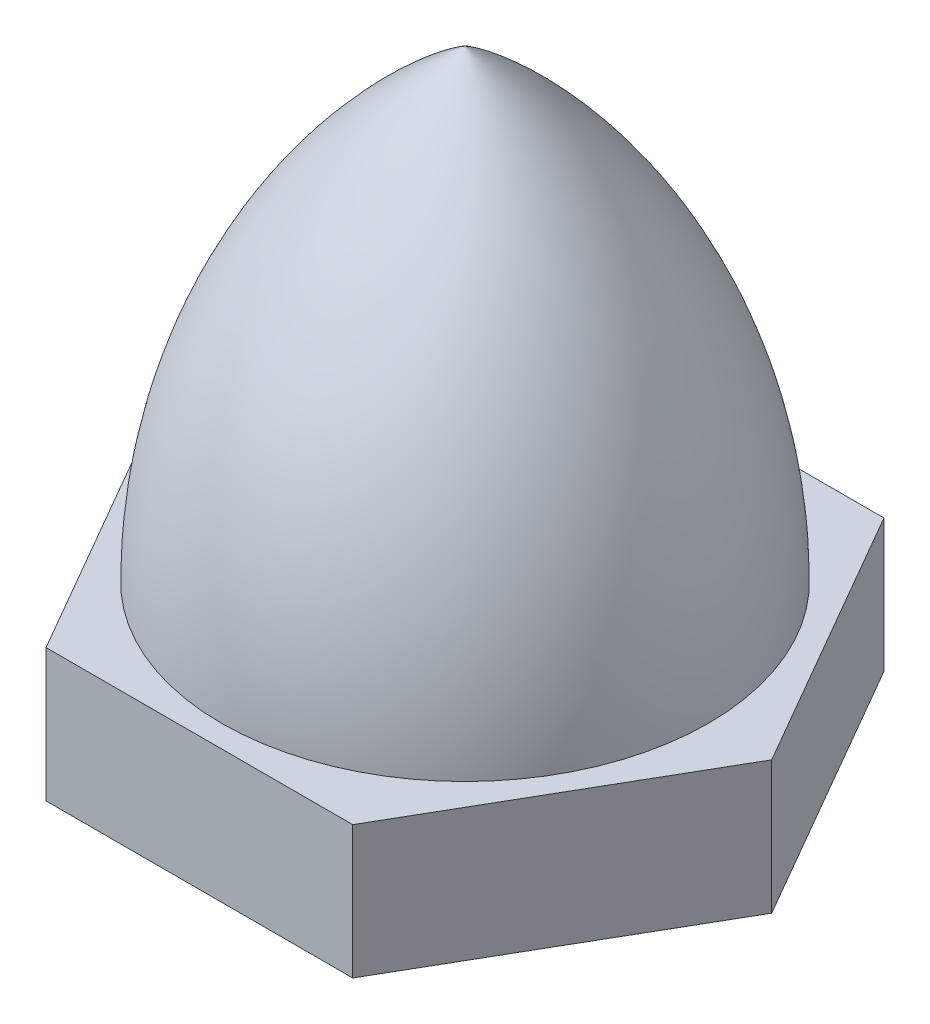
ISO-10303-21;
HEADER;
FILE_DESCRIPTION(('STEP AP214'),'2;1');
FILE_NAME('part.step','',(''),(''),'','','');
FILE_SCHEMA(('AUTOMOTIVE_DESIGN { 1 0 10303 214 1 1 1 1 }'));
ENDSEC;
DATA;
#1=APPLICATION_CONTEXT('core data for automotive mechanical design processes');
#2=APPLICATION_PROTOCOL_DEFINITION('international standard','automotive_design',2000,#1);
#3=PRODUCT_CONTEXT('',#1,'mechanical');
#4=PRODUCT('Part','Part','',(#3));
#5=PRODUCT_RELATED_PRODUCT_CATEGORY('part','',(#4));
#6=PRODUCT_DEFINITION_FORMATION('','',#4);
#7=PRODUCT_DEFINITION_CONTEXT('part definition',#1,'design');
#8=PRODUCT_DEFINITION('design','',#6,#7);
#9=PRODUCT_DEFINITION_SHAPE('','',#8);
#10=(LENGTH_UNIT() NAMED_UNIT(*) SI_UNIT(.MILLI.,.METRE.));
#11=(NAMED_UNIT(*) PLANE_ANGLE_UNIT() SI_UNIT($,.RADIAN.));
#12=(NAMED_UNIT(*) SI_UNIT($,.STERADIAN.) SOLID_ANGLE_UNIT());
#13=UNCERTAINTY_MEASURE_WITH_UNIT(LENGTH_MEASURE(1.E-05),#10,'distance_accuracy_value','');
#14=(GEOMETRIC_REPRESENTATION_CONTEXT(3) GLOBAL_UNCERTAINTY_ASSIGNED_CONTEXT((#13)) GLOBAL_UNIT_ASSIGNED_CONTEXT((#10,
#11,#12)) REPRESENTATION_CONTEXT('',''));
#15=CARTESIAN_POINT('',(0.,0.,0.));
#16=DIRECTION('',(0.,0.,1.));
#17=DIRECTION('',(1.,0.,0.));
#18=AXIS2_PLACEMENT_3D('',#15,#16,#17);
#19=CARTESIAN_POINT('',(3.46410161513776,3.,6.));
#20=DIRECTION('',(-0.866025403784439,0.,-0.5));
#21=DIRECTION('',(-0.5,0.,0.866025403784439));
#22=AXIS2_PLACEMENT_3D('',#19,#20,#21);
#23=PLANE('',#22);
#24=DIRECTION('',(0.5,0.,-0.866025403784439));
#25=VECTOR('',#24,1.);
#26=CARTESIAN_POINT('',(3.46410161513776,0.,6.));
#27=LINE('',#26,#25);
#28=CARTESIAN_POINT('',(3.46410161513776,0.,6.));
#29=VERTEX_POINT('',#28);
#30=CARTESIAN_POINT('',(6.92820323027551,0.,0.));
#31=VERTEX_POINT('',#30);
#32=EDGE_CURVE('E125',#29,#31,#27,.T.);
#33=ORIENTED_EDGE('',*,*,#32,.T.);
#34=DIRECTION('',(0.,-1.,0.));
#35=VECTOR('',#34,1.);
#36=CARTESIAN_POINT('',(6.92820323027551,3.,0.));
#37=LINE('',#36,#35);
#38=CARTESIAN_POINT('',(6.92820323027551,3.,0.));
#39=VERTEX_POINT('',#38);
#40=EDGE_CURVE('E45',#39,#31,#37,.T.);
#41=ORIENTED_EDGE('',*,*,#40,.F.);
#42=DIRECTION('',(0.5,0.,-0.866025403784439));
#43=VECTOR('',#42,1.);
#44=CARTESIAN_POINT('',(3.46410161513776,3.,6.));
#45=LINE('',#44,#43);
#46=CARTESIAN_POINT('',(3.46410161513776,3.,6.));
#47=VERTEX_POINT('',#46);
#48=EDGE_CURVE('E136',#47,#39,#45,.T.);
#49=ORIENTED_EDGE('',*,*,#48,.F.);
#50=DIRECTION('',(0.,-1.,0.));
#51=VECTOR('',#50,1.);
#52=CARTESIAN_POINT('',(3.46410161513776,3.,6.));
#53=LINE('',#52,#51);
#54=EDGE_CURVE('E121',#47,#29,#53,.T.);
#55=ORIENTED_EDGE('',*,*,#54,.T.);
#56=EDGE_LOOP('',(#33,#41,#49,#55));
#57=FACE_BOUND('',#56,.T.);
#58=ADVANCED_FACE('F37',(#57),#23,.F.);
#59=CARTESIAN_POINT('',(6.92820323027551,3.,0.));
#60=DIRECTION('',(-0.866025403784439,0.,0.5));
#61=DIRECTION('',(0.5,0.,0.866025403784439));
#62=AXIS2_PLACEMENT_3D('',#59,#60,#61);
#63=PLANE('',#62);
#64=DIRECTION('',(-0.5,0.,-0.866025403784439));
#65=VECTOR('',#64,1.);
#66=CARTESIAN_POINT('',(6.92820323027551,0.,0.));
#67=LINE('',#66,#65);
#68=CARTESIAN_POINT('',(3.46410161513775,0.,-6.));
#69=VERTEX_POINT('',#68);
#70=EDGE_CURVE('E128',#31,#69,#67,.T.);
#71=ORIENTED_EDGE('',*,*,#70,.T.);
#72=DIRECTION('',(0.,-1.,0.));
#73=VECTOR('',#72,1.);
#74=CARTESIAN_POINT('',(3.46410161513775,3.,-6.));
#75=LINE('',#74,#73);
#76=CARTESIAN_POINT('',(3.46410161513775,3.,-6.));
#77=VERTEX_POINT('',#76);
#78=EDGE_CURVE('E140',#77,#69,#75,.T.);
#79=ORIENTED_EDGE('',*,*,#78,.F.);
#80=DIRECTION('',(-0.5,0.,-0.866025403784439));
#81=VECTOR('',#80,1.);
#82=CARTESIAN_POINT('',(6.92820323027551,3.,0.));
#83=LINE('',#82,#81);
#84=EDGE_CURVE('E92',#39,#77,#83,.T.);
#85=ORIENTED_EDGE('',*,*,#84,.F.);
#86=ORIENTED_EDGE('',*,*,#40,.T.);
#87=EDGE_LOOP('',(#71,#79,#85,#86));
#88=FACE_BOUND('',#87,.T.);
#89=ADVANCED_FACE('F143',(#88),#63,.F.);
#90=CARTESIAN_POINT('',(3.46410161513775,3.,-6.));
#91=DIRECTION('',(0.,0.,1.));
#92=DIRECTION('',(1.,0.,0.));
#93=AXIS2_PLACEMENT_3D('',#90,#91,#92);
#94=PLANE('',#93);
#95=DIRECTION('',(-1.,0.,0.));
#96=VECTOR('',#95,1.);
#97=CARTESIAN_POINT('',(3.46410161513775,0.,-6.));
#98=LINE('',#97,#96);
#99=CARTESIAN_POINT('',(-3.46410161513775,0.,-6.));
#100=VERTEX_POINT('',#99);
#101=EDGE_CURVE('E131',#69,#100,#98,.T.);
#102=ORIENTED_EDGE('',*,*,#101,.T.);
#103=DIRECTION('',(0.,-1.,0.));
#104=VECTOR('',#103,1.);
#105=CARTESIAN_POINT('',(-3.46410161513775,3.,-6.));
#106=LINE('',#105,#104);
#107=CARTESIAN_POINT('',(-3.46410161513775,3.,-6.));
#108=VERTEX_POINT('',#107);
#109=EDGE_CURVE('E116',#108,#100,#106,.T.);
#110=ORIENTED_EDGE('',*,*,#109,.F.);
#111=DIRECTION('',(-1.,0.,0.));
#112=VECTOR('',#111,1.);
#113=CARTESIAN_POINT('',(3.46410161513775,3.,-6.));
#114=LINE('',#113,#112);
#115=EDGE_CURVE('E107',#77,#108,#114,.T.);
#116=ORIENTED_EDGE('',*,*,#115,.F.);
#117=ORIENTED_EDGE('',*,*,#78,.T.);
#118=EDGE_LOOP('',(#102,#110,#116,#117));
#119=FACE_BOUND('',#118,.T.);
#120=ADVANCED_FACE('F151',(#119),#94,.F.);
#121=CARTESIAN_POINT('',(-3.46410161513775,3.,-6.));
#122=DIRECTION('',(0.866025403784439,0.,0.5));
#123=DIRECTION('',(0.5,0.,-0.866025403784439));
#124=AXIS2_PLACEMENT_3D('',#121,#122,#123);
#125=PLANE('',#124);
#126=DIRECTION('',(-0.5,0.,0.866025403784438));
#127=VECTOR('',#126,1.);
#128=CARTESIAN_POINT('',(-3.46410161513775,0.,-6.));
#129=LINE('',#128,#127);
#130=CARTESIAN_POINT('',(-6.92820323027551,0.,0.));
#131=VERTEX_POINT('',#130);
#132=EDGE_CURVE('E115',#100,#131,#129,.T.);
#133=ORIENTED_EDGE('',*,*,#132,.T.);
#134=DIRECTION('',(0.,-1.,0.));
#135=VECTOR('',#134,1.);
#136=CARTESIAN_POINT('',(-6.92820323027551,3.,0.));
#137=LINE('',#136,#135);
#138=CARTESIAN_POINT('',(-6.92820323027551,3.,0.));
#139=VERTEX_POINT('',#138);
#140=EDGE_CURVE('E112',#139,#131,#137,.T.);
#141=ORIENTED_EDGE('',*,*,#140,.F.);
#142=DIRECTION('',(-0.5,0.,0.866025403784438));
#143=VECTOR('',#142,1.);
#144=CARTESIAN_POINT('',(-3.46410161513775,3.,-6.));
#145=LINE('',#144,#143);
#146=EDGE_CURVE('E101',#108,#139,#145,.T.);
#147=ORIENTED_EDGE('',*,*,#146,.F.);
#148=ORIENTED_EDGE('',*,*,#109,.T.);
#149=EDGE_LOOP('',(#133,#141,#147,#148));
#150=FACE_BOUND('',#149,.T.);
#151=ADVANCED_FACE('F113',(#150),#125,.F.);
#152=CARTESIAN_POINT('',(-6.92820323027551,3.,0.));
#153=DIRECTION('',(0.866025403784438,0.,-0.500000000000001));
#154=DIRECTION('',(-0.500000000000001,0.,-0.866025403784438));
#155=AXIS2_PLACEMENT_3D('',#152,#153,#154);
#156=PLANE('',#155);
#157=DIRECTION('',(0.5,0.,0.866025403784438));
#158=VECTOR('',#157,1.);
#159=CARTESIAN_POINT('',(-6.92820323027551,0.,0.));
#160=LINE('',#159,#158);
#161=CARTESIAN_POINT('',(-3.46410161513775,0.,6.));
#162=VERTEX_POINT('',#161);
#163=EDGE_CURVE('E77',#131,#162,#160,.T.);
#164=ORIENTED_EDGE('',*,*,#163,.T.);
#165=DIRECTION('',(0.,-1.,0.));
#166=VECTOR('',#165,1.);
#167=CARTESIAN_POINT('',(-3.46410161513775,3.,6.));
#168=LINE('',#167,#166);
#169=CARTESIAN_POINT('',(-3.46410161513775,3.,6.));
#170=VERTEX_POINT('',#169);
#171=EDGE_CURVE('E117',#170,#162,#168,.T.);
#172=ORIENTED_EDGE('',*,*,#171,.F.);
#173=DIRECTION('',(0.5,0.,0.866025403784438));
#174=VECTOR('',#173,1.);
#175=CARTESIAN_POINT('',(-6.92820323027551,3.,0.));
#176=LINE('',#175,#174);
#177=EDGE_CURVE('E105',#139,#170,#176,.T.);
#178=ORIENTED_EDGE('',*,*,#177,.F.);
#179=ORIENTED_EDGE('',*,*,#140,.T.);
#180=EDGE_LOOP('',(#164,#172,#178,#179));
#181=FACE_BOUND('',#180,.T.);
#182=ADVANCED_FACE('F119',(#181),#156,.F.);
#183=CARTESIAN_POINT('',(-3.46410161513775,3.,6.));
#184=DIRECTION('',(0.,0.,-1.));
#185=DIRECTION('',(-1.,0.,0.));
#186=AXIS2_PLACEMENT_3D('',#183,#184,#185);
#187=PLANE('',#186);
#188=DIRECTION('',(1.,0.,0.));
#189=VECTOR('',#188,1.);
#190=CARTESIAN_POINT('',(-3.46410161513775,0.,6.));
#191=LINE('',#190,#189);
#192=EDGE_CURVE('E83',#162,#29,#191,.T.);
#193=ORIENTED_EDGE('',*,*,#192,.T.);
#194=ORIENTED_EDGE('',*,*,#54,.F.);
#195=DIRECTION('',(1.,0.,0.));
#196=VECTOR('',#195,1.);
#197=CARTESIAN_POINT('',(-3.46410161513775,3.,6.));
#198=LINE('',#197,#196);
#199=EDGE_CURVE('E53',#170,#47,#198,.T.);
#200=ORIENTED_EDGE('',*,*,#199,.F.);
#201=ORIENTED_EDGE('',*,*,#171,.T.);
#202=EDGE_LOOP('',(#193,#194,#200,#201));
#203=FACE_BOUND('',#202,.T.);
#204=ADVANCED_FACE('F173',(#203),#187,.F.);
#205=CARTESIAN_POINT('',(0.,3.,0.));
#206=DIRECTION('',(0.,1.,0.));
#207=DIRECTION('',(0.,0.,1.));
#208=AXIS2_PLACEMENT_3D('',#205,#206,#207);
#209=PLANE('',#208);
#210=CARTESIAN_POINT('',(0.,3.,0.));
#211=DIRECTION('',(0.,1.,0.));
#212=DIRECTION('',(0.,0.,1.));
#213=AXIS2_PLACEMENT_3D('',#210,#211,#212);
#214=CIRCLE('',#213,5.5);
#215=CARTESIAN_POINT('',(0.,3.,5.5));
#216=VERTEX_POINT('',#215);
#217=EDGE_CURVE('E11',#216,#216,#214,.T.);
#218=ORIENTED_EDGE('',*,*,#217,.F.);
#219=EDGE_LOOP('',(#218));
#220=FACE_BOUND('',#219,.T.);
#221=ORIENTED_EDGE('',*,*,#48,.T.);
#222=ORIENTED_EDGE('',*,*,#84,.T.);
#223=ORIENTED_EDGE('',*,*,#115,.T.);
#224=ORIENTED_EDGE('',*,*,#146,.T.);
#225=ORIENTED_EDGE('',*,*,#177,.T.);
#226=ORIENTED_EDGE('',*,*,#199,.T.);
#227=EDGE_LOOP('',(#221,#222,#223,#224,#225,#226));
#228=FACE_BOUND('',#227,.T.);
#229=ADVANCED_FACE('F103',(#220,#228),#209,.T.);
#230=CARTESIAN_POINT('',(0.,0.,0.));
#231=DIRECTION('',(0.,1.,0.));
#232=DIRECTION('',(0.,0.,1.));
#233=AXIS2_PLACEMENT_3D('',#230,#231,#232);
#234=PLANE('',#233);
#235=CARTESIAN_POINT('',(0.,0.,0.));
#236=DIRECTION('',(0.,-1.,0.));
#237=DIRECTION('',(0.,0.,-1.));
#238=AXIS2_PLACEMENT_3D('',#235,#236,#237);
#239=CIRCLE('',#238,2.5);
#240=CARTESIAN_POINT('',(0.,0.,-2.5));
#241=VERTEX_POINT('',#240);
#242=EDGE_CURVE('E157',#241,#241,#239,.T.);
#243=ORIENTED_EDGE('',*,*,#242,.F.);
#244=EDGE_LOOP('',(#243));
#245=FACE_BOUND('',#244,.T.);
#246=ORIENTED_EDGE('',*,*,#32,.F.);
#247=ORIENTED_EDGE('',*,*,#192,.F.);
#248=ORIENTED_EDGE('',*,*,#163,.F.);
#249=ORIENTED_EDGE('',*,*,#132,.F.);
#250=ORIENTED_EDGE('',*,*,#101,.F.);
#251=ORIENTED_EDGE('',*,*,#70,.F.);
#252=EDGE_LOOP('',(#246,#247,#248,#249,#250,#251));
#253=FACE_BOUND('',#252,.T.);
#254=ADVANCED_FACE('F148',(#245,#253),#234,.F.);
#255=CARTESIAN_POINT('',(-7.27272727272727,3.,0.));
#256=DIRECTION('',(0.,0.,-1.));
#257=DIRECTION('',(1.,0.,0.));
#258=AXIS2_PLACEMENT_3D('',#255,#256,#257);
#259=CIRCLE('',#258,12.7727272727273);
#260=TRIMMED_CURVE('',#259,(PARAMETER_VALUE(-0.965026590044954)),
(PARAMETER_VALUE(0.965026590044954)),.T.,.PARAMETER.);
#261=CARTESIAN_POINT('',(0.,3.,0.));
#262=DIRECTION('',(0.,-1.,0.));
#263=AXIS1_PLACEMENT('',#261,#262);
#264=SURFACE_OF_REVOLUTION('',#260,#263);
#265=CARTESIAN_POINT('',(0.,13.5,0.));
#266=VERTEX_POINT('',#265);
#267=VERTEX_LOOP('',#266);
#268=FACE_BOUND('',#267,.T.);
#269=ORIENTED_EDGE('',*,*,#217,.T.);
#270=EDGE_LOOP('',(#269));
#271=FACE_BOUND('',#270,.T.);
#272=ADVANCED_FACE('F164',(#268,#271),#264,.T.);
#273=CARTESIAN_POINT('',(0.,10.,0.));
#274=DIRECTION('',(0.,-1.,0.));
#275=DIRECTION('',(0.,0.,-1.));
#276=AXIS2_PLACEMENT_3D('',#273,#274,#275);
#277=CONICAL_SURFACE('',#276,2.5,1.02974425867665);
#278=CARTESIAN_POINT('',(0.,11.5021515475689,0.));
#279=VERTEX_POINT('',#278);
#280=VERTEX_LOOP('',#279);
#281=FACE_BOUND('',#280,.T.);
#282=CARTESIAN_POINT('',(0.,10.,0.));
#283=DIRECTION('',(0.,-1.,0.));
#284=DIRECTION('',(0.,0.,-1.));
#285=AXIS2_PLACEMENT_3D('',#282,#283,#284);
#286=CIRCLE('',#285,2.5);
#287=CARTESIAN_POINT('',(0.,10.,-2.5));
#288=VERTEX_POINT('',#287);
#289=EDGE_CURVE('E129',#288,#288,#286,.T.);
#290=ORIENTED_EDGE('',*,*,#289,.T.);
#291=EDGE_LOOP('',(#290));
#292=FACE_BOUND('',#291,.T.);
#293=ADVANCED_FACE('F170',(#281,#292),#277,.F.);
#294=CARTESIAN_POINT('',(0.,0.,0.));
#295=DIRECTION('',(0.,-1.,0.));
#296=DIRECTION('',(0.,0.,-1.));
#297=AXIS2_PLACEMENT_3D('',#294,#295,#296);
#298=CYLINDRICAL_SURFACE('',#297,2.5);
#299=ORIENTED_EDGE('',*,*,#289,.F.);
#300=EDGE_LOOP('',(#299));
#301=FACE_BOUND('',#300,.T.);
#302=ORIENTED_EDGE('',*,*,#242,.T.);
#303=EDGE_LOOP('',(#302));
#304=FACE_BOUND('',#303,.T.);
#305=ADVANCED_FACE('F161',(#301,#304),#298,.F.);
#306=CLOSED_SHELL('',(#58,#89,#120,#151,#182,#204,#229,#254,#272,#293,#305));
#307=MANIFOLD_SOLID_BREP('B2',#306);
#308=ADVANCED_BREP_SHAPE_REPRESENTATION('',(#18,#307),#14);
#309=SHAPE_DEFINITION_REPRESENTATION(#9,#308);
ENDSEC;
END-ISO-10303-21;
